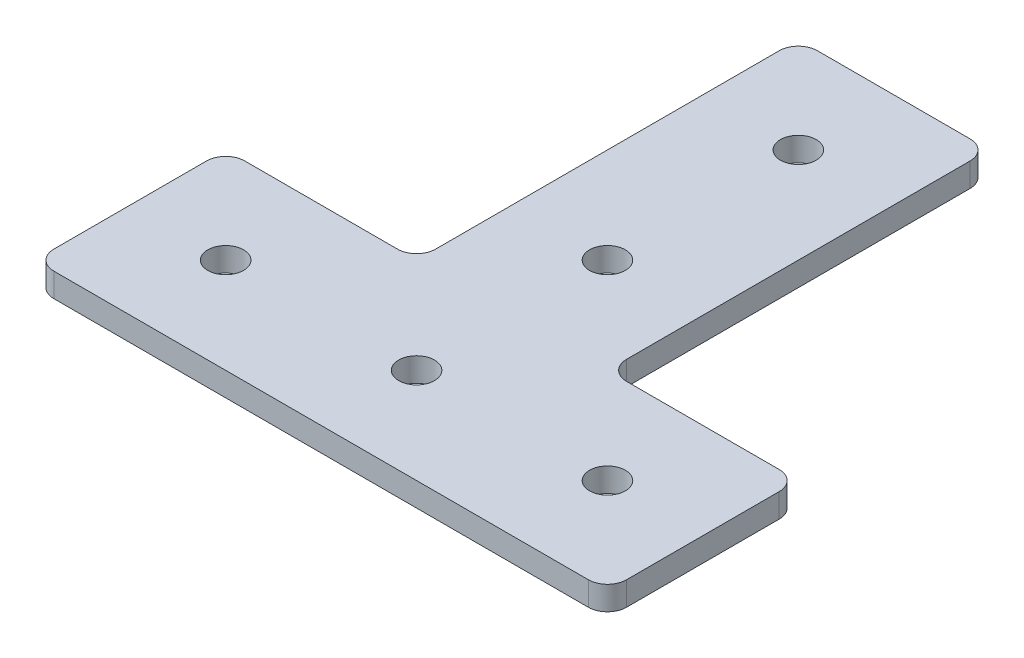
ISO-10303-21;
HEADER;
FILE_DESCRIPTION(('STEP AP214'),'2;1');
FILE_NAME('part.step','',(''),(''),'','','');
FILE_SCHEMA(('AUTOMOTIVE_DESIGN { 1 0 10303 214 1 1 1 1 }'));
ENDSEC;
DATA;
#1=APPLICATION_CONTEXT('core data for automotive mechanical design processes');
#2=APPLICATION_PROTOCOL_DEFINITION('international standard','automotive_design',2000,#1);
#3=PRODUCT_CONTEXT('',#1,'mechanical');
#4=PRODUCT('Part','Part','',(#3));
#5=PRODUCT_RELATED_PRODUCT_CATEGORY('part','',(#4));
#6=PRODUCT_DEFINITION_FORMATION('','',#4);
#7=PRODUCT_DEFINITION_CONTEXT('part definition',#1,'design');
#8=PRODUCT_DEFINITION('design','',#6,#7);
#9=PRODUCT_DEFINITION_SHAPE('','',#8);
#10=(LENGTH_UNIT() NAMED_UNIT(*) SI_UNIT(.MILLI.,.METRE.));
#11=(NAMED_UNIT(*) PLANE_ANGLE_UNIT() SI_UNIT($,.RADIAN.));
#12=(NAMED_UNIT(*) SI_UNIT($,.STERADIAN.) SOLID_ANGLE_UNIT());
#13=UNCERTAINTY_MEASURE_WITH_UNIT(LENGTH_MEASURE(1.E-05),#10,'distance_accuracy_value','');
#14=(GEOMETRIC_REPRESENTATION_CONTEXT(3) GLOBAL_UNCERTAINTY_ASSIGNED_CONTEXT((#13)) GLOBAL_UNIT_ASSIGNED_CONTEXT((#10,
#11,#12)) REPRESENTATION_CONTEXT('',''));
#15=CARTESIAN_POINT('',(0.,0.,0.));
#16=DIRECTION('',(0.,0.,1.));
#17=DIRECTION('',(1.,0.,0.));
#18=AXIS2_PLACEMENT_3D('',#15,#16,#17);
#19=CARTESIAN_POINT('',(13.6405439330544,3.175,-65.7557112970711));
#20=DIRECTION('',(0.,1.,0.));
#21=DIRECTION('',(0.,0.,1.));
#22=AXIS2_PLACEMENT_3D('',#19,#20,#21);
#23=PLANE('',#22);
#24=CARTESIAN_POINT('',(3.48054393305439,3.175,-30.1957112970711));
#25=DIRECTION('',(0.,1.,0.));
#26=DIRECTION('',(0.,0.,1.));
#27=AXIS2_PLACEMENT_3D('',#24,#25,#26);
#28=CIRCLE('',#27,2.38125);
#29=CARTESIAN_POINT('',(3.48054393305439,3.175,-27.8144612970711));
#30=VERTEX_POINT('',#29);
#31=EDGE_CURVE('E349',#30,#30,#28,.T.);
#32=ORIENTED_EDGE('',*,*,#31,.F.);
#33=EDGE_LOOP('',(#32));
#34=FACE_BOUND('',#33,.T.);
#35=CARTESIAN_POINT('',(-21.9194560669456,3.175,-4.79571129707114));
#36=DIRECTION('',(0.,1.,0.));
#37=DIRECTION('',(0.,0.,1.));
#38=AXIS2_PLACEMENT_3D('',#35,#36,#37);
#39=CIRCLE('',#38,2.38125);
#40=CARTESIAN_POINT('',(-21.9194560669456,3.175,-2.41446129707113));
#41=VERTEX_POINT('',#40);
#42=EDGE_CURVE('E361',#41,#41,#39,.T.);
#43=ORIENTED_EDGE('',*,*,#42,.F.);
#44=EDGE_LOOP('',(#43));
#45=FACE_BOUND('',#44,.T.);
#46=CARTESIAN_POINT('',(13.6405439330544,3.175,-65.7557112970711));
#47=DIRECTION('',(0.,1.,0.));
#48=DIRECTION('',(0.,0.,1.));
#49=AXIS2_PLACEMENT_3D('',#46,#47,#48);
#50=CIRCLE('',#49,2.54);
#51=CARTESIAN_POINT('',(16.1805439330544,3.175,-65.7557112970711));
#52=VERTEX_POINT('',#51);
#53=CARTESIAN_POINT('',(13.6405439330544,3.175,-68.2957112970711));
#54=VERTEX_POINT('',#53);
#55=EDGE_CURVE('E211',#52,#54,#50,.T.);
#56=ORIENTED_EDGE('',*,*,#55,.T.);
#57=DIRECTION('',(-1.,0.,0.));
#58=VECTOR('',#57,1.);
#59=CARTESIAN_POINT('',(-6.6794560669456,3.175,-68.2957112970711));
#60=LINE('',#59,#58);
#61=CARTESIAN_POINT('',(-6.67945606694562,3.175,-68.2957112970711));
#62=VERTEX_POINT('',#61);
#63=EDGE_CURVE('E119',#54,#62,#60,.T.);
#64=ORIENTED_EDGE('',*,*,#63,.T.);
#65=CARTESIAN_POINT('',(-6.67945606694562,3.175,-65.7557112970711));
#66=DIRECTION('',(0.,1.,0.));
#67=DIRECTION('',(0.,0.,-1.));
#68=AXIS2_PLACEMENT_3D('',#65,#66,#67);
#69=CIRCLE('',#68,2.54);
#70=CARTESIAN_POINT('',(-9.21945606694562,3.175,-65.7557112970711));
#71=VERTEX_POINT('',#70);
#72=EDGE_CURVE('E250',#62,#71,#69,.T.);
#73=ORIENTED_EDGE('',*,*,#72,.T.);
#74=DIRECTION('',(0.,0.,1.));
#75=VECTOR('',#74,1.);
#76=CARTESIAN_POINT('',(-9.21945606694562,3.175,-20.0357112970712));
#77=LINE('',#76,#75);
#78=CARTESIAN_POINT('',(-9.21945606694562,3.175,-20.0357112970712));
#79=VERTEX_POINT('',#78);
#80=EDGE_CURVE('E269',#71,#79,#77,.T.);
#81=ORIENTED_EDGE('',*,*,#80,.T.);
#82=CARTESIAN_POINT('',(-11.7594560669456,3.175,-20.0357112970711));
#83=DIRECTION('',(0.,-1.,0.));
#84=DIRECTION('',(0.,0.,1.));
#85=AXIS2_PLACEMENT_3D('',#82,#83,#84);
#86=CIRCLE('',#85,2.54);
#87=CARTESIAN_POINT('',(-11.7594560669456,3.175,-17.4957112970711));
#88=VERTEX_POINT('',#87);
#89=EDGE_CURVE('E266',#79,#88,#86,.T.);
#90=ORIENTED_EDGE('',*,*,#89,.T.);
#91=DIRECTION('',(-1.,0.,0.));
#92=VECTOR('',#91,1.);
#93=CARTESIAN_POINT('',(-32.0794560669456,3.175,-17.4957112970711));
#94=LINE('',#93,#92);
#95=CARTESIAN_POINT('',(-32.0794560669456,3.175,-17.4957112970711));
#96=VERTEX_POINT('',#95);
#97=EDGE_CURVE('E268',#88,#96,#94,.T.);
#98=ORIENTED_EDGE('',*,*,#97,.T.);
#99=CARTESIAN_POINT('',(-32.0794560669456,3.175,-14.9557112970711));
#100=DIRECTION('',(0.,1.,0.));
#101=DIRECTION('',(0.,0.,-1.));
#102=AXIS2_PLACEMENT_3D('',#99,#100,#101);
#103=CIRCLE('',#102,2.54);
#104=CARTESIAN_POINT('',(-34.6194560669456,3.175,-14.9557112970711));
#105=VERTEX_POINT('',#104);
#106=EDGE_CURVE('E271',#96,#105,#103,.T.);
#107=ORIENTED_EDGE('',*,*,#106,.T.);
#108=DIRECTION('',(0.,0.,1.));
#109=VECTOR('',#108,1.);
#110=CARTESIAN_POINT('',(-34.6194560669456,3.175,-14.9557112970711));
#111=LINE('',#110,#109);
#112=CARTESIAN_POINT('',(-34.6194560669456,3.175,5.36428870292885));
#113=VERTEX_POINT('',#112);
#114=EDGE_CURVE('E277',#105,#113,#111,.T.);
#115=ORIENTED_EDGE('',*,*,#114,.T.);
#116=CARTESIAN_POINT('',(-32.0794560669456,3.175,5.36428870292887));
#117=DIRECTION('',(0.,1.,0.));
#118=DIRECTION('',(0.,0.,-1.));
#119=AXIS2_PLACEMENT_3D('',#116,#117,#118);
#120=CIRCLE('',#119,2.54);
#121=CARTESIAN_POINT('',(-32.0794560669456,3.175,7.90428870292886));
#122=VERTEX_POINT('',#121);
#123=EDGE_CURVE('E279',#113,#122,#120,.T.);
#124=ORIENTED_EDGE('',*,*,#123,.T.);
#125=DIRECTION('',(1.,0.,0.));
#126=VECTOR('',#125,1.);
#127=CARTESIAN_POINT('',(-32.0794560669456,3.175,7.90428870292886));
#128=LINE('',#127,#126);
#129=CARTESIAN_POINT('',(39.0405439330544,3.175,7.90428870292886));
#130=VERTEX_POINT('',#129);
#131=EDGE_CURVE('E281',#122,#130,#128,.T.);
#132=ORIENTED_EDGE('',*,*,#131,.T.);
#133=CARTESIAN_POINT('',(39.0405439330544,3.175,5.36428870292886));
#134=DIRECTION('',(0.,1.,0.));
#135=DIRECTION('',(0.,0.,-1.));
#136=AXIS2_PLACEMENT_3D('',#133,#134,#135);
#137=CIRCLE('',#136,2.54);
#138=CARTESIAN_POINT('',(41.5805439330544,3.175,5.36428870292885));
#139=VERTEX_POINT('',#138);
#140=EDGE_CURVE('E283',#130,#139,#137,.T.);
#141=ORIENTED_EDGE('',*,*,#140,.T.);
#142=DIRECTION('',(0.,0.,-1.));
#143=VECTOR('',#142,1.);
#144=CARTESIAN_POINT('',(41.5805439330544,3.175,-14.9557112970711));
#145=LINE('',#144,#143);
#146=CARTESIAN_POINT('',(41.5805439330544,3.175,-14.9557112970711));
#147=VERTEX_POINT('',#146);
#148=EDGE_CURVE('E285',#139,#147,#145,.T.);
#149=ORIENTED_EDGE('',*,*,#148,.T.);
#150=CARTESIAN_POINT('',(39.0405439330544,3.175,-14.9557112970711));
#151=DIRECTION('',(0.,1.,0.));
#152=DIRECTION('',(0.,0.,-1.));
#153=AXIS2_PLACEMENT_3D('',#150,#151,#152);
#154=CIRCLE('',#153,2.54);
#155=CARTESIAN_POINT('',(39.0405439330544,3.175,-17.4957112970711));
#156=VERTEX_POINT('',#155);
#157=EDGE_CURVE('E162',#147,#156,#154,.T.);
#158=ORIENTED_EDGE('',*,*,#157,.T.);
#159=DIRECTION('',(-1.,0.,0.));
#160=VECTOR('',#159,1.);
#161=CARTESIAN_POINT('',(18.7205439330544,3.175,-17.4957112970711));
#162=LINE('',#161,#160);
#163=CARTESIAN_POINT('',(18.7205439330544,3.175,-17.4957112970711));
#164=VERTEX_POINT('',#163);
#165=EDGE_CURVE('E156',#156,#164,#162,.T.);
#166=ORIENTED_EDGE('',*,*,#165,.T.);
#167=CARTESIAN_POINT('',(18.7205439330544,3.175,-20.0357112970711));
#168=DIRECTION('',(0.,-1.,0.));
#169=DIRECTION('',(0.,0.,1.));
#170=AXIS2_PLACEMENT_3D('',#167,#168,#169);
#171=CIRCLE('',#170,2.54);
#172=CARTESIAN_POINT('',(16.1805439330544,3.175,-20.0357112970712));
#173=VERTEX_POINT('',#172);
#174=EDGE_CURVE('E160',#164,#173,#171,.T.);
#175=ORIENTED_EDGE('',*,*,#174,.T.);
#176=DIRECTION('',(0.,0.,-1.));
#177=VECTOR('',#176,1.);
#178=CARTESIAN_POINT('',(16.1805439330544,3.175,-20.0357112970712));
#179=LINE('',#178,#177);
#180=EDGE_CURVE('E52',#173,#52,#179,.T.);
#181=ORIENTED_EDGE('',*,*,#180,.T.);
#182=EDGE_LOOP('',(#56,#64,#73,#81,#90,#98,#107,#115,#124,#132,#141,#149,#158,#166,#175,#181));
#183=FACE_BOUND('',#182,.T.);
#184=CARTESIAN_POINT('',(3.48054393305439,3.175,-4.79571129707114));
#185=DIRECTION('',(0.,1.,0.));
#186=DIRECTION('',(0.,0.,1.));
#187=AXIS2_PLACEMENT_3D('',#184,#185,#186);
#188=CIRCLE('',#187,2.38125);
#189=CARTESIAN_POINT('',(3.48054393305439,3.175,-2.41446129707114));
#190=VERTEX_POINT('',#189);
#191=EDGE_CURVE('E184',#190,#190,#188,.T.);
#192=ORIENTED_EDGE('',*,*,#191,.F.);
#193=EDGE_LOOP('',(#192));
#194=FACE_BOUND('',#193,.T.);
#195=CARTESIAN_POINT('',(28.8805439330544,3.175,-4.79571129707114));
#196=DIRECTION('',(0.,1.,0.));
#197=DIRECTION('',(0.,0.,1.));
#198=AXIS2_PLACEMENT_3D('',#195,#196,#197);
#199=CIRCLE('',#198,2.38125);
#200=CARTESIAN_POINT('',(28.8805439330544,3.175,-2.41446129707113));
#201=VERTEX_POINT('',#200);
#202=EDGE_CURVE('E355',#201,#201,#199,.T.);
#203=ORIENTED_EDGE('',*,*,#202,.F.);
#204=EDGE_LOOP('',(#203));
#205=FACE_BOUND('',#204,.T.);
#206=CARTESIAN_POINT('',(3.48054393305439,3.175,-55.5957112970711));
#207=DIRECTION('',(0.,1.,0.));
#208=DIRECTION('',(0.,0.,1.));
#209=AXIS2_PLACEMENT_3D('',#206,#207,#208);
#210=CIRCLE('',#209,2.38125);
#211=CARTESIAN_POINT('',(3.48054393305439,3.175,-53.2144612970711));
#212=VERTEX_POINT('',#211);
#213=EDGE_CURVE('E340',#212,#212,#210,.T.);
#214=ORIENTED_EDGE('',*,*,#213,.F.);
#215=EDGE_LOOP('',(#214));
#216=FACE_BOUND('',#215,.T.);
#217=ADVANCED_FACE('F35',(#34,#45,#183,#194,#205,#216),#23,.T.);
#218=CARTESIAN_POINT('',(13.6405439330544,0.,-65.7557112970711));
#219=DIRECTION('',(0.,1.,0.));
#220=DIRECTION('',(0.,0.,1.));
#221=AXIS2_PLACEMENT_3D('',#218,#219,#220);
#222=PLANE('',#221);
#223=CARTESIAN_POINT('',(13.6405439330544,0.,-65.7557112970711));
#224=DIRECTION('',(0.,1.,0.));
#225=DIRECTION('',(0.,0.,1.));
#226=AXIS2_PLACEMENT_3D('',#223,#224,#225);
#227=CIRCLE('',#226,2.54);
#228=CARTESIAN_POINT('',(16.1805439330544,0.,-65.7557112970711));
#229=VERTEX_POINT('',#228);
#230=CARTESIAN_POINT('',(13.6405439330544,0.,-68.2957112970711));
#231=VERTEX_POINT('',#230);
#232=EDGE_CURVE('E180',#229,#231,#227,.T.);
#233=ORIENTED_EDGE('',*,*,#232,.F.);
#234=DIRECTION('',(0.,0.,-1.));
#235=VECTOR('',#234,1.);
#236=CARTESIAN_POINT('',(16.1805439330544,0.,-20.0357112970712));
#237=LINE('',#236,#235);
#238=CARTESIAN_POINT('',(16.1805439330544,0.,-20.0357112970712));
#239=VERTEX_POINT('',#238);
#240=EDGE_CURVE('E111',#239,#229,#237,.T.);
#241=ORIENTED_EDGE('',*,*,#240,.F.);
#242=CARTESIAN_POINT('',(18.7205439330544,0.,-20.0357112970711));
#243=DIRECTION('',(0.,-1.,0.));
#244=DIRECTION('',(0.,0.,1.));
#245=AXIS2_PLACEMENT_3D('',#242,#243,#244);
#246=CIRCLE('',#245,2.54);
#247=CARTESIAN_POINT('',(18.7205439330544,0.,-17.4957112970711));
#248=VERTEX_POINT('',#247);
#249=EDGE_CURVE('E105',#248,#239,#246,.T.);
#250=ORIENTED_EDGE('',*,*,#249,.F.);
#251=DIRECTION('',(-1.,0.,0.));
#252=VECTOR('',#251,1.);
#253=CARTESIAN_POINT('',(18.7205439330544,0.,-17.4957112970711));
#254=LINE('',#253,#252);
#255=CARTESIAN_POINT('',(39.0405439330544,0.,-17.4957112970711));
#256=VERTEX_POINT('',#255);
#257=EDGE_CURVE('E170',#256,#248,#254,.T.);
#258=ORIENTED_EDGE('',*,*,#257,.F.);
#259=CARTESIAN_POINT('',(39.0405439330544,0.,-14.9557112970711));
#260=DIRECTION('',(0.,1.,0.));
#261=DIRECTION('',(0.,0.,-1.));
#262=AXIS2_PLACEMENT_3D('',#259,#260,#261);
#263=CIRCLE('',#262,2.54);
#264=CARTESIAN_POINT('',(41.5805439330544,0.,-14.9557112970711));
#265=VERTEX_POINT('',#264);
#266=EDGE_CURVE('E206',#265,#256,#263,.T.);
#267=ORIENTED_EDGE('',*,*,#266,.F.);
#268=DIRECTION('',(0.,0.,-1.));
#269=VECTOR('',#268,1.);
#270=CARTESIAN_POINT('',(41.5805439330544,0.,-14.9557112970711));
#271=LINE('',#270,#269);
#272=CARTESIAN_POINT('',(41.5805439330544,0.,5.36428870292885));
#273=VERTEX_POINT('',#272);
#274=EDGE_CURVE('E204',#273,#265,#271,.T.);
#275=ORIENTED_EDGE('',*,*,#274,.F.);
#276=CARTESIAN_POINT('',(39.0405439330544,0.,5.36428870292886));
#277=DIRECTION('',(0.,1.,0.));
#278=DIRECTION('',(0.,0.,-1.));
#279=AXIS2_PLACEMENT_3D('',#276,#277,#278);
#280=CIRCLE('',#279,2.54);
#281=CARTESIAN_POINT('',(39.0405439330544,0.,7.90428870292886));
#282=VERTEX_POINT('',#281);
#283=EDGE_CURVE('E202',#282,#273,#280,.T.);
#284=ORIENTED_EDGE('',*,*,#283,.F.);
#285=DIRECTION('',(1.,0.,0.));
#286=VECTOR('',#285,1.);
#287=CARTESIAN_POINT('',(-32.0794560669456,0.,7.90428870292886));
#288=LINE('',#287,#286);
#289=CARTESIAN_POINT('',(-32.0794560669456,0.,7.90428870292886));
#290=VERTEX_POINT('',#289);
#291=EDGE_CURVE('E200',#290,#282,#288,.T.);
#292=ORIENTED_EDGE('',*,*,#291,.F.);
#293=CARTESIAN_POINT('',(-32.0794560669456,0.,5.36428870292887));
#294=DIRECTION('',(0.,1.,0.));
#295=DIRECTION('',(0.,0.,-1.));
#296=AXIS2_PLACEMENT_3D('',#293,#294,#295);
#297=CIRCLE('',#296,2.54);
#298=CARTESIAN_POINT('',(-34.6194560669456,0.,5.36428870292885));
#299=VERTEX_POINT('',#298);
#300=EDGE_CURVE('E198',#299,#290,#297,.T.);
#301=ORIENTED_EDGE('',*,*,#300,.F.);
#302=DIRECTION('',(0.,0.,1.));
#303=VECTOR('',#302,1.);
#304=CARTESIAN_POINT('',(-34.6194560669456,0.,-14.9557112970711));
#305=LINE('',#304,#303);
#306=CARTESIAN_POINT('',(-34.6194560669456,0.,-14.9557112970711));
#307=VERTEX_POINT('',#306);
#308=EDGE_CURVE('E196',#307,#299,#305,.T.);
#309=ORIENTED_EDGE('',*,*,#308,.F.);
#310=CARTESIAN_POINT('',(-32.0794560669456,0.,-14.9557112970711));
#311=DIRECTION('',(0.,1.,0.));
#312=DIRECTION('',(0.,0.,-1.));
#313=AXIS2_PLACEMENT_3D('',#310,#311,#312);
#314=CIRCLE('',#313,2.54);
#315=CARTESIAN_POINT('',(-32.0794560669456,0.,-17.4957112970711));
#316=VERTEX_POINT('',#315);
#317=EDGE_CURVE('E194',#316,#307,#314,.T.);
#318=ORIENTED_EDGE('',*,*,#317,.F.);
#319=DIRECTION('',(-1.,0.,0.));
#320=VECTOR('',#319,1.);
#321=CARTESIAN_POINT('',(-32.0794560669456,0.,-17.4957112970711));
#322=LINE('',#321,#320);
#323=CARTESIAN_POINT('',(-11.7594560669456,0.,-17.4957112970711));
#324=VERTEX_POINT('',#323);
#325=EDGE_CURVE('E192',#324,#316,#322,.T.);
#326=ORIENTED_EDGE('',*,*,#325,.F.);
#327=CARTESIAN_POINT('',(-11.7594560669456,0.,-20.0357112970711));
#328=DIRECTION('',(0.,-1.,0.));
#329=DIRECTION('',(0.,0.,1.));
#330=AXIS2_PLACEMENT_3D('',#327,#328,#329);
#331=CIRCLE('',#330,2.54);
#332=CARTESIAN_POINT('',(-9.21945606694562,0.,-20.0357112970712));
#333=VERTEX_POINT('',#332);
#334=EDGE_CURVE('E190',#333,#324,#331,.T.);
#335=ORIENTED_EDGE('',*,*,#334,.F.);
#336=DIRECTION('',(0.,0.,1.));
#337=VECTOR('',#336,1.);
#338=CARTESIAN_POINT('',(-9.21945606694562,0.,-20.0357112970712));
#339=LINE('',#338,#337);
#340=CARTESIAN_POINT('',(-9.21945606694562,0.,-65.7557112970711));
#341=VERTEX_POINT('',#340);
#342=EDGE_CURVE('E188',#341,#333,#339,.T.);
#343=ORIENTED_EDGE('',*,*,#342,.F.);
#344=CARTESIAN_POINT('',(-6.67945606694562,0.,-65.7557112970711));
#345=DIRECTION('',(0.,1.,0.));
#346=DIRECTION('',(0.,0.,-1.));
#347=AXIS2_PLACEMENT_3D('',#344,#345,#346);
#348=CIRCLE('',#347,2.54);
#349=CARTESIAN_POINT('',(-6.67945606694562,0.,-68.2957112970711));
#350=VERTEX_POINT('',#349);
#351=EDGE_CURVE('E186',#350,#341,#348,.T.);
#352=ORIENTED_EDGE('',*,*,#351,.F.);
#353=DIRECTION('',(-1.,0.,0.));
#354=VECTOR('',#353,1.);
#355=CARTESIAN_POINT('',(-6.6794560669456,0.,-68.2957112970711));
#356=LINE('',#355,#354);
#357=EDGE_CURVE('E183',#231,#350,#356,.T.);
#358=ORIENTED_EDGE('',*,*,#357,.F.);
#359=EDGE_LOOP('',(#233,#241,#250,#258,#267,#275,#284,#292,#301,#309,#318,#326,#335,#343,#352,#358));
#360=FACE_BOUND('',#359,.T.);
#361=CARTESIAN_POINT('',(3.48054393305439,0.,-4.79571129707114));
#362=DIRECTION('',(0.,1.,0.));
#363=DIRECTION('',(0.,0.,1.));
#364=AXIS2_PLACEMENT_3D('',#361,#362,#363);
#365=CIRCLE('',#364,2.38125);
#366=CARTESIAN_POINT('',(3.48054393305439,0.,-2.41446129707114));
#367=VERTEX_POINT('',#366);
#368=EDGE_CURVE('E364',#367,#367,#365,.T.);
#369=ORIENTED_EDGE('',*,*,#368,.T.);
#370=EDGE_LOOP('',(#369));
#371=FACE_BOUND('',#370,.T.);
#372=CARTESIAN_POINT('',(-21.9194560669456,0.,-4.79571129707114));
#373=DIRECTION('',(0.,1.,0.));
#374=DIRECTION('',(0.,0.,1.));
#375=AXIS2_PLACEMENT_3D('',#372,#373,#374);
#376=CIRCLE('',#375,2.38125);
#377=CARTESIAN_POINT('',(-21.9194560669456,0.,-2.41446129707113));
#378=VERTEX_POINT('',#377);
#379=EDGE_CURVE('E358',#378,#378,#376,.T.);
#380=ORIENTED_EDGE('',*,*,#379,.T.);
#381=EDGE_LOOP('',(#380));
#382=FACE_BOUND('',#381,.T.);
#383=CARTESIAN_POINT('',(28.8805439330544,0.,-4.79571129707114));
#384=DIRECTION('',(0.,1.,0.));
#385=DIRECTION('',(0.,0.,1.));
#386=AXIS2_PLACEMENT_3D('',#383,#384,#385);
#387=CIRCLE('',#386,2.38125);
#388=CARTESIAN_POINT('',(28.8805439330544,0.,-2.41446129707113));
#389=VERTEX_POINT('',#388);
#390=EDGE_CURVE('E352',#389,#389,#387,.T.);
#391=ORIENTED_EDGE('',*,*,#390,.T.);
#392=EDGE_LOOP('',(#391));
#393=FACE_BOUND('',#392,.T.);
#394=CARTESIAN_POINT('',(3.48054393305439,0.,-30.1957112970711));
#395=DIRECTION('',(0.,1.,0.));
#396=DIRECTION('',(0.,0.,1.));
#397=AXIS2_PLACEMENT_3D('',#394,#395,#396);
#398=CIRCLE('',#397,2.38125);
#399=CARTESIAN_POINT('',(3.48054393305439,0.,-27.8144612970711));
#400=VERTEX_POINT('',#399);
#401=EDGE_CURVE('E346',#400,#400,#398,.T.);
#402=ORIENTED_EDGE('',*,*,#401,.T.);
#403=EDGE_LOOP('',(#402));
#404=FACE_BOUND('',#403,.T.);
#405=CARTESIAN_POINT('',(3.48054393305439,0.,-55.5957112970711));
#406=DIRECTION('',(0.,1.,0.));
#407=DIRECTION('',(0.,0.,1.));
#408=AXIS2_PLACEMENT_3D('',#405,#406,#407);
#409=CIRCLE('',#408,2.38125);
#410=CARTESIAN_POINT('',(3.48054393305439,0.,-53.2144612970711));
#411=VERTEX_POINT('',#410);
#412=EDGE_CURVE('E343',#411,#411,#409,.T.);
#413=ORIENTED_EDGE('',*,*,#412,.T.);
#414=EDGE_LOOP('',(#413));
#415=FACE_BOUND('',#414,.T.);
#416=ADVANCED_FACE('F254',(#360,#371,#382,#393,#404,#415),#222,.F.);
#417=CARTESIAN_POINT('',(13.6405439330544,3.175,-65.7557112970711));
#418=DIRECTION('',(0.,-1.,0.));
#419=DIRECTION('',(0.,0.,-1.));
#420=AXIS2_PLACEMENT_3D('',#417,#418,#419);
#421=CYLINDRICAL_SURFACE('',#420,2.54);
#422=ORIENTED_EDGE('',*,*,#232,.T.);
#423=DIRECTION('',(0.,-1.,0.));
#424=VECTOR('',#423,1.);
#425=CARTESIAN_POINT('',(13.6405439330544,3.175,-68.2957112970711));
#426=LINE('',#425,#424);
#427=EDGE_CURVE('E11',#54,#231,#426,.T.);
#428=ORIENTED_EDGE('',*,*,#427,.F.);
#429=ORIENTED_EDGE('',*,*,#55,.F.);
#430=DIRECTION('',(0.,-1.,0.));
#431=VECTOR('',#430,1.);
#432=CARTESIAN_POINT('',(16.1805439330544,3.175,-65.7557112970711));
#433=LINE('',#432,#431);
#434=EDGE_CURVE('E176',#52,#229,#433,.T.);
#435=ORIENTED_EDGE('',*,*,#434,.T.);
#436=EDGE_LOOP('',(#422,#428,#429,#435));
#437=FACE_BOUND('',#436,.T.);
#438=ADVANCED_FACE('F37',(#437),#421,.T.);
#439=CARTESIAN_POINT('',(-6.6794560669456,3.175,-68.2957112970711));
#440=DIRECTION('',(0.,0.,1.));
#441=DIRECTION('',(1.,0.,0.));
#442=AXIS2_PLACEMENT_3D('',#439,#440,#441);
#443=PLANE('',#442);
#444=ORIENTED_EDGE('',*,*,#357,.T.);
#445=DIRECTION('',(0.,-1.,0.));
#446=VECTOR('',#445,1.);
#447=CARTESIAN_POINT('',(-6.67945606694562,3.175,-68.2957112970711));
#448=LINE('',#447,#446);
#449=EDGE_CURVE('E44',#62,#350,#448,.T.);
#450=ORIENTED_EDGE('',*,*,#449,.F.);
#451=ORIENTED_EDGE('',*,*,#63,.F.);
#452=ORIENTED_EDGE('',*,*,#427,.T.);
#453=EDGE_LOOP('',(#444,#450,#451,#452));
#454=FACE_BOUND('',#453,.T.);
#455=ADVANCED_FACE('F523',(#454),#443,.F.);
#456=CARTESIAN_POINT('',(-6.67945606694562,3.175,-65.7557112970711));
#457=DIRECTION('',(0.,-1.,0.));
#458=DIRECTION('',(0.,0.,-1.));
#459=AXIS2_PLACEMENT_3D('',#456,#457,#458);
#460=CYLINDRICAL_SURFACE('',#459,2.54);
#461=ORIENTED_EDGE('',*,*,#351,.T.);
#462=DIRECTION('',(0.,-1.,0.));
#463=VECTOR('',#462,1.);
#464=CARTESIAN_POINT('',(-9.21945606694562,3.175,-65.7557112970711));
#465=LINE('',#464,#463);
#466=EDGE_CURVE('E242',#71,#341,#465,.T.);
#467=ORIENTED_EDGE('',*,*,#466,.F.);
#468=ORIENTED_EDGE('',*,*,#72,.F.);
#469=ORIENTED_EDGE('',*,*,#449,.T.);
#470=EDGE_LOOP('',(#461,#467,#468,#469));
#471=FACE_BOUND('',#470,.T.);
#472=ADVANCED_FACE('F248',(#471),#460,.T.);
#473=CARTESIAN_POINT('',(-9.21945606694562,3.175,-20.0357112970712));
#474=DIRECTION('',(1.,0.,0.));
#475=DIRECTION('',(0.,0.,-1.));
#476=AXIS2_PLACEMENT_3D('',#473,#474,#475);
#477=PLANE('',#476);
#478=ORIENTED_EDGE('',*,*,#342,.T.);
#479=DIRECTION('',(0.,-1.,0.));
#480=VECTOR('',#479,1.);
#481=CARTESIAN_POINT('',(-9.21945606694562,3.175,-20.0357112970712));
#482=LINE('',#481,#480);
#483=EDGE_CURVE('E239',#79,#333,#482,.T.);
#484=ORIENTED_EDGE('',*,*,#483,.F.);
#485=ORIENTED_EDGE('',*,*,#80,.F.);
#486=ORIENTED_EDGE('',*,*,#466,.T.);
#487=EDGE_LOOP('',(#478,#484,#485,#486));
#488=FACE_BOUND('',#487,.T.);
#489=ADVANCED_FACE('F260',(#488),#477,.F.);
#490=CARTESIAN_POINT('',(-11.7594560669456,3.175,-20.0357112970711));
#491=DIRECTION('',(0.,-1.,0.));
#492=DIRECTION('',(0.,0.,-1.));
#493=AXIS2_PLACEMENT_3D('',#490,#491,#492);
#494=CYLINDRICAL_SURFACE('',#493,2.54);
#495=ORIENTED_EDGE('',*,*,#334,.T.);
#496=DIRECTION('',(0.,-1.,0.));
#497=VECTOR('',#496,1.);
#498=CARTESIAN_POINT('',(-11.7594560669456,3.175,-17.4957112970711));
#499=LINE('',#498,#497);
#500=EDGE_CURVE('E236',#88,#324,#499,.T.);
#501=ORIENTED_EDGE('',*,*,#500,.F.);
#502=ORIENTED_EDGE('',*,*,#89,.F.);
#503=ORIENTED_EDGE('',*,*,#483,.T.);
#504=EDGE_LOOP('',(#495,#501,#502,#503));
#505=FACE_BOUND('',#504,.T.);
#506=ADVANCED_FACE('F264',(#505),#494,.F.);
#507=CARTESIAN_POINT('',(-32.0794560669456,3.175,-17.4957112970711));
#508=DIRECTION('',(0.,0.,1.));
#509=DIRECTION('',(1.,0.,0.));
#510=AXIS2_PLACEMENT_3D('',#507,#508,#509);
#511=PLANE('',#510);
#512=ORIENTED_EDGE('',*,*,#325,.T.);
#513=DIRECTION('',(0.,-1.,0.));
#514=VECTOR('',#513,1.);
#515=CARTESIAN_POINT('',(-32.0794560669456,3.175,-17.4957112970711));
#516=LINE('',#515,#514);
#517=EDGE_CURVE('E233',#96,#316,#516,.T.);
#518=ORIENTED_EDGE('',*,*,#517,.F.);
#519=ORIENTED_EDGE('',*,*,#97,.F.);
#520=ORIENTED_EDGE('',*,*,#500,.T.);
#521=EDGE_LOOP('',(#512,#518,#519,#520));
#522=FACE_BOUND('',#521,.T.);
#523=ADVANCED_FACE('F488',(#522),#511,.F.);
#524=CARTESIAN_POINT('',(-32.0794560669456,3.175,-14.9557112970711));
#525=DIRECTION('',(0.,-1.,0.));
#526=DIRECTION('',(0.,0.,-1.));
#527=AXIS2_PLACEMENT_3D('',#524,#525,#526);
#528=CYLINDRICAL_SURFACE('',#527,2.54);
#529=ORIENTED_EDGE('',*,*,#317,.T.);
#530=DIRECTION('',(0.,-1.,0.));
#531=VECTOR('',#530,1.);
#532=CARTESIAN_POINT('',(-34.6194560669456,3.175,-14.9557112970711));
#533=LINE('',#532,#531);
#534=EDGE_CURVE('E230',#105,#307,#533,.T.);
#535=ORIENTED_EDGE('',*,*,#534,.F.);
#536=ORIENTED_EDGE('',*,*,#106,.F.);
#537=ORIENTED_EDGE('',*,*,#517,.T.);
#538=EDGE_LOOP('',(#529,#535,#536,#537));
#539=FACE_BOUND('',#538,.T.);
#540=ADVANCED_FACE('F478',(#539),#528,.T.);
#541=CARTESIAN_POINT('',(-34.6194560669456,3.175,-14.9557112970711));
#542=DIRECTION('',(1.,0.,0.));
#543=DIRECTION('',(0.,0.,-1.));
#544=AXIS2_PLACEMENT_3D('',#541,#542,#543);
#545=PLANE('',#544);
#546=ORIENTED_EDGE('',*,*,#308,.T.);
#547=DIRECTION('',(0.,-1.,0.));
#548=VECTOR('',#547,1.);
#549=CARTESIAN_POINT('',(-34.6194560669456,3.175,5.36428870292885));
#550=LINE('',#549,#548);
#551=EDGE_CURVE('E227',#113,#299,#550,.T.);
#552=ORIENTED_EDGE('',*,*,#551,.F.);
#553=ORIENTED_EDGE('',*,*,#114,.F.);
#554=ORIENTED_EDGE('',*,*,#534,.T.);
#555=EDGE_LOOP('',(#546,#552,#553,#554));
#556=FACE_BOUND('',#555,.T.);
#557=ADVANCED_FACE('F468',(#556),#545,.F.);
#558=CARTESIAN_POINT('',(-32.0794560669456,3.175,5.36428870292887));
#559=DIRECTION('',(0.,-1.,0.));
#560=DIRECTION('',(0.,0.,-1.));
#561=AXIS2_PLACEMENT_3D('',#558,#559,#560);
#562=CYLINDRICAL_SURFACE('',#561,2.54);
#563=ORIENTED_EDGE('',*,*,#300,.T.);
#564=DIRECTION('',(0.,-1.,0.));
#565=VECTOR('',#564,1.);
#566=CARTESIAN_POINT('',(-32.0794560669456,3.175,7.90428870292886));
#567=LINE('',#566,#565);
#568=EDGE_CURVE('E224',#122,#290,#567,.T.);
#569=ORIENTED_EDGE('',*,*,#568,.F.);
#570=ORIENTED_EDGE('',*,*,#123,.F.);
#571=ORIENTED_EDGE('',*,*,#551,.T.);
#572=EDGE_LOOP('',(#563,#569,#570,#571));
#573=FACE_BOUND('',#572,.T.);
#574=ADVANCED_FACE('F458',(#573),#562,.T.);
#575=CARTESIAN_POINT('',(-32.0794560669456,3.175,7.90428870292886));
#576=DIRECTION('',(0.,0.,-1.));
#577=DIRECTION('',(-1.,0.,0.));
#578=AXIS2_PLACEMENT_3D('',#575,#576,#577);
#579=PLANE('',#578);
#580=ORIENTED_EDGE('',*,*,#291,.T.);
#581=DIRECTION('',(0.,-1.,0.));
#582=VECTOR('',#581,1.);
#583=CARTESIAN_POINT('',(39.0405439330544,3.175,7.90428870292886));
#584=LINE('',#583,#582);
#585=EDGE_CURVE('E221',#130,#282,#584,.T.);
#586=ORIENTED_EDGE('',*,*,#585,.F.);
#587=ORIENTED_EDGE('',*,*,#131,.F.);
#588=ORIENTED_EDGE('',*,*,#568,.T.);
#589=EDGE_LOOP('',(#580,#586,#587,#588));
#590=FACE_BOUND('',#589,.T.);
#591=ADVANCED_FACE('F448',(#590),#579,.F.);
#592=CARTESIAN_POINT('',(39.0405439330544,3.175,5.36428870292886));
#593=DIRECTION('',(0.,-1.,0.));
#594=DIRECTION('',(0.,0.,-1.));
#595=AXIS2_PLACEMENT_3D('',#592,#593,#594);
#596=CYLINDRICAL_SURFACE('',#595,2.54);
#597=ORIENTED_EDGE('',*,*,#283,.T.);
#598=DIRECTION('',(0.,-1.,0.));
#599=VECTOR('',#598,1.);
#600=CARTESIAN_POINT('',(41.5805439330544,3.175,5.36428870292885));
#601=LINE('',#600,#599);
#602=EDGE_CURVE('E218',#139,#273,#601,.T.);
#603=ORIENTED_EDGE('',*,*,#602,.F.);
#604=ORIENTED_EDGE('',*,*,#140,.F.);
#605=ORIENTED_EDGE('',*,*,#585,.T.);
#606=EDGE_LOOP('',(#597,#603,#604,#605));
#607=FACE_BOUND('',#606,.T.);
#608=ADVANCED_FACE('F439',(#607),#596,.T.);
#609=CARTESIAN_POINT('',(41.5805439330544,3.175,-14.9557112970711));
#610=DIRECTION('',(-1.,0.,0.));
#611=DIRECTION('',(0.,0.,1.));
#612=AXIS2_PLACEMENT_3D('',#609,#610,#611);
#613=PLANE('',#612);
#614=ORIENTED_EDGE('',*,*,#274,.T.);
#615=DIRECTION('',(0.,-1.,0.));
#616=VECTOR('',#615,1.);
#617=CARTESIAN_POINT('',(41.5805439330544,3.175,-14.9557112970711));
#618=LINE('',#617,#616);
#619=EDGE_CURVE('E215',#147,#265,#618,.T.);
#620=ORIENTED_EDGE('',*,*,#619,.F.);
#621=ORIENTED_EDGE('',*,*,#148,.F.);
#622=ORIENTED_EDGE('',*,*,#602,.T.);
#623=EDGE_LOOP('',(#614,#620,#621,#622));
#624=FACE_BOUND('',#623,.T.);
#625=ADVANCED_FACE('F291',(#624),#613,.F.);
#626=CARTESIAN_POINT('',(39.0405439330544,3.175,-14.9557112970711));
#627=DIRECTION('',(0.,-1.,0.));
#628=DIRECTION('',(0.,0.,-1.));
#629=AXIS2_PLACEMENT_3D('',#626,#627,#628);
#630=CYLINDRICAL_SURFACE('',#629,2.54);
#631=ORIENTED_EDGE('',*,*,#266,.T.);
#632=DIRECTION('',(0.,-1.,0.));
#633=VECTOR('',#632,1.);
#634=CARTESIAN_POINT('',(39.0405439330544,3.175,-17.4957112970711));
#635=LINE('',#634,#633);
#636=EDGE_CURVE('E171',#156,#256,#635,.T.);
#637=ORIENTED_EDGE('',*,*,#636,.F.);
#638=ORIENTED_EDGE('',*,*,#157,.F.);
#639=ORIENTED_EDGE('',*,*,#619,.T.);
#640=EDGE_LOOP('',(#631,#637,#638,#639));
#641=FACE_BOUND('',#640,.T.);
#642=ADVANCED_FACE('F295',(#641),#630,.T.);
#643=CARTESIAN_POINT('',(18.7205439330544,3.175,-17.4957112970711));
#644=DIRECTION('',(0.,0.,1.));
#645=DIRECTION('',(1.,0.,0.));
#646=AXIS2_PLACEMENT_3D('',#643,#644,#645);
#647=PLANE('',#646);
#648=ORIENTED_EDGE('',*,*,#257,.T.);
#649=DIRECTION('',(0.,-1.,0.));
#650=VECTOR('',#649,1.);
#651=CARTESIAN_POINT('',(18.7205439330544,3.175,-17.4957112970711));
#652=LINE('',#651,#650);
#653=EDGE_CURVE('E167',#164,#248,#652,.T.);
#654=ORIENTED_EDGE('',*,*,#653,.F.);
#655=ORIENTED_EDGE('',*,*,#165,.F.);
#656=ORIENTED_EDGE('',*,*,#636,.T.);
#657=EDGE_LOOP('',(#648,#654,#655,#656));
#658=FACE_BOUND('',#657,.T.);
#659=ADVANCED_FACE('F168',(#658),#647,.F.);
#660=CARTESIAN_POINT('',(18.7205439330544,3.175,-20.0357112970711));
#661=DIRECTION('',(0.,-1.,0.));
#662=DIRECTION('',(0.,0.,-1.));
#663=AXIS2_PLACEMENT_3D('',#660,#661,#662);
#664=CYLINDRICAL_SURFACE('',#663,2.54);
#665=ORIENTED_EDGE('',*,*,#249,.T.);
#666=DIRECTION('',(0.,-1.,0.));
#667=VECTOR('',#666,1.);
#668=CARTESIAN_POINT('',(16.1805439330544,3.175,-20.0357112970712));
#669=LINE('',#668,#667);
#670=EDGE_CURVE('E172',#173,#239,#669,.T.);
#671=ORIENTED_EDGE('',*,*,#670,.F.);
#672=ORIENTED_EDGE('',*,*,#174,.F.);
#673=ORIENTED_EDGE('',*,*,#653,.T.);
#674=EDGE_LOOP('',(#665,#671,#672,#673));
#675=FACE_BOUND('',#674,.T.);
#676=ADVANCED_FACE('F174',(#675),#664,.F.);
#677=CARTESIAN_POINT('',(16.1805439330544,3.175,-20.0357112970712));
#678=DIRECTION('',(-1.,0.,0.));
#679=DIRECTION('',(0.,0.,1.));
#680=AXIS2_PLACEMENT_3D('',#677,#678,#679);
#681=PLANE('',#680);
#682=ORIENTED_EDGE('',*,*,#240,.T.);
#683=ORIENTED_EDGE('',*,*,#434,.F.);
#684=ORIENTED_EDGE('',*,*,#180,.F.);
#685=ORIENTED_EDGE('',*,*,#670,.T.);
#686=EDGE_LOOP('',(#682,#683,#684,#685));
#687=FACE_BOUND('',#686,.T.);
#688=ADVANCED_FACE('F299',(#687),#681,.F.);
#689=CARTESIAN_POINT('',(3.48054393305439,3.175,-4.79571129707114));
#690=DIRECTION('',(0.,-1.,0.));
#691=DIRECTION('',(0.,0.,-1.));
#692=AXIS2_PLACEMENT_3D('',#689,#690,#691);
#693=CYLINDRICAL_SURFACE('',#692,2.38125);
#694=ORIENTED_EDGE('',*,*,#191,.T.);
#695=EDGE_LOOP('',(#694));
#696=FACE_BOUND('',#695,.T.);
#697=ORIENTED_EDGE('',*,*,#368,.F.);
#698=EDGE_LOOP('',(#697));
#699=FACE_BOUND('',#698,.T.);
#700=ADVANCED_FACE('F301',(#696,#699),#693,.F.);
#701=CARTESIAN_POINT('',(-21.9194560669456,3.175,-4.79571129707114));
#702=DIRECTION('',(0.,-1.,0.));
#703=DIRECTION('',(0.,0.,-1.));
#704=AXIS2_PLACEMENT_3D('',#701,#702,#703);
#705=CYLINDRICAL_SURFACE('',#704,2.38125);
#706=ORIENTED_EDGE('',*,*,#42,.T.);
#707=EDGE_LOOP('',(#706));
#708=FACE_BOUND('',#707,.T.);
#709=ORIENTED_EDGE('',*,*,#379,.F.);
#710=EDGE_LOOP('',(#709));
#711=FACE_BOUND('',#710,.T.);
#712=ADVANCED_FACE('F307',(#708,#711),#705,.F.);
#713=CARTESIAN_POINT('',(28.8805439330544,3.175,-4.79571129707114));
#714=DIRECTION('',(0.,-1.,0.));
#715=DIRECTION('',(0.,0.,-1.));
#716=AXIS2_PLACEMENT_3D('',#713,#714,#715);
#717=CYLINDRICAL_SURFACE('',#716,2.38125);
#718=ORIENTED_EDGE('',*,*,#202,.T.);
#719=EDGE_LOOP('',(#718));
#720=FACE_BOUND('',#719,.T.);
#721=ORIENTED_EDGE('',*,*,#390,.F.);
#722=EDGE_LOOP('',(#721));
#723=FACE_BOUND('',#722,.T.);
#724=ADVANCED_FACE('F323',(#720,#723),#717,.F.);
#725=CARTESIAN_POINT('',(3.48054393305439,3.175,-30.1957112970711));
#726=DIRECTION('',(0.,-1.,0.));
#727=DIRECTION('',(0.,0.,-1.));
#728=AXIS2_PLACEMENT_3D('',#725,#726,#727);
#729=CYLINDRICAL_SURFACE('',#728,2.38125);
#730=ORIENTED_EDGE('',*,*,#31,.T.);
#731=EDGE_LOOP('',(#730));
#732=FACE_BOUND('',#731,.T.);
#733=ORIENTED_EDGE('',*,*,#401,.F.);
#734=EDGE_LOOP('',(#733));
#735=FACE_BOUND('',#734,.T.);
#736=ADVANCED_FACE('F327',(#732,#735),#729,.F.);
#737=CARTESIAN_POINT('',(3.48054393305439,3.175,-55.5957112970711));
#738=DIRECTION('',(0.,-1.,0.));
#739=DIRECTION('',(0.,0.,-1.));
#740=AXIS2_PLACEMENT_3D('',#737,#738,#739);
#741=CYLINDRICAL_SURFACE('',#740,2.38125);
#742=ORIENTED_EDGE('',*,*,#213,.T.);
#743=EDGE_LOOP('',(#742));
#744=FACE_BOUND('',#743,.T.);
#745=ORIENTED_EDGE('',*,*,#412,.F.);
#746=EDGE_LOOP('',(#745));
#747=FACE_BOUND('',#746,.T.);
#748=ADVANCED_FACE('F331',(#744,#747),#741,.F.);
#749=CLOSED_SHELL('',(#217,#416,#438,#455,#472,#489,#506,#523,#540,#557,#574,#591,#608,#625,
#642,#659,#676,#688,#700,#712,#724,#736,#748));
#750=MANIFOLD_SOLID_BREP('B2',#749);
#751=ADVANCED_BREP_SHAPE_REPRESENTATION('',(#18,#750),#14);
#752=SHAPE_DEFINITION_REPRESENTATION(#9,#751);
ENDSEC;
END-ISO-10303-21;
